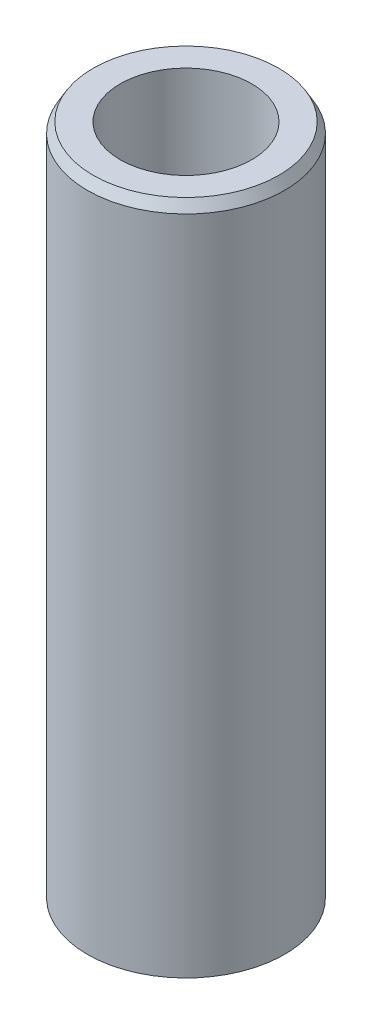
ISO-10303-21;
HEADER;
FILE_DESCRIPTION(('STEP AP214'),'2;1');
FILE_NAME('part.step','',(''),(''),'','','');
FILE_SCHEMA(('AUTOMOTIVE_DESIGN { 1 0 10303 214 1 1 1 1 }'));
ENDSEC;
DATA;
#1=APPLICATION_CONTEXT('core data for automotive mechanical design processes');
#2=APPLICATION_PROTOCOL_DEFINITION('international standard','automotive_design',2000,#1);
#3=PRODUCT_CONTEXT('',#1,'mechanical');
#4=PRODUCT('Part','Part','',(#3));
#5=PRODUCT_RELATED_PRODUCT_CATEGORY('part','',(#4));
#6=PRODUCT_DEFINITION_FORMATION('','',#4);
#7=PRODUCT_DEFINITION_CONTEXT('part definition',#1,'design');
#8=PRODUCT_DEFINITION('design','',#6,#7);
#9=PRODUCT_DEFINITION_SHAPE('','',#8);
#10=(LENGTH_UNIT() NAMED_UNIT(*) SI_UNIT(.MILLI.,.METRE.));
#11=(NAMED_UNIT(*) PLANE_ANGLE_UNIT() SI_UNIT($,.RADIAN.));
#12=(NAMED_UNIT(*) SI_UNIT($,.STERADIAN.) SOLID_ANGLE_UNIT());
#13=UNCERTAINTY_MEASURE_WITH_UNIT(LENGTH_MEASURE(1.E-05),#10,'distance_accuracy_value','');
#14=(GEOMETRIC_REPRESENTATION_CONTEXT(3) GLOBAL_UNCERTAINTY_ASSIGNED_CONTEXT((#13)) GLOBAL_UNIT_ASSIGNED_CONTEXT((#10,
#11,#12)) REPRESENTATION_CONTEXT('',''));
#15=CARTESIAN_POINT('',(0.,0.,0.));
#16=DIRECTION('',(0.,0.,1.));
#17=DIRECTION('',(1.,0.,0.));
#18=AXIS2_PLACEMENT_3D('',#15,#16,#17);
#19=CARTESIAN_POINT('',(0.,343.483602576055,0.));
#20=DIRECTION('',(0.,-1.,0.));
#21=DIRECTION('',(0.,0.,-1.));
#22=AXIS2_PLACEMENT_3D('',#19,#20,#21);
#23=CYLINDRICAL_SURFACE('',#22,50.);
#24=CARTESIAN_POINT('',(0.,338.351122495451,0.));
#25=DIRECTION('',(0.,1.,0.));
#26=DIRECTION('',(0.,0.,1.));
#27=AXIS2_PLACEMENT_3D('',#24,#25,#26);
#28=CIRCLE('',#27,50.);
#29=CARTESIAN_POINT('',(0.,338.351122495451,50.));
#30=VERTEX_POINT('',#29);
#31=EDGE_CURVE('E50',#30,#30,#28,.F.);
#32=ORIENTED_EDGE('',*,*,#31,.T.);
#33=EDGE_LOOP('',(#32));
#34=FACE_BOUND('',#33,.T.);
#35=CARTESIAN_POINT('',(0.,2.96323875614746,0.));
#36=DIRECTION('',(0.,1.,0.));
#37=DIRECTION('',(0.,0.,1.));
#38=AXIS2_PLACEMENT_3D('',#35,#36,#37);
#39=CIRCLE('',#38,50.);
#40=CARTESIAN_POINT('',(0.,2.96323875614746,50.));
#41=VERTEX_POINT('',#40);
#42=EDGE_CURVE('E51',#41,#41,#39,.T.);
#43=ORIENTED_EDGE('',*,*,#42,.T.);
#44=EDGE_LOOP('',(#43));
#45=FACE_BOUND('',#44,.T.);
#46=ADVANCED_FACE('F39',(#34,#45),#23,.T.);
#47=CARTESIAN_POINT('',(0.,343.483602576055,0.));
#48=DIRECTION('',(0.,1.,0.));
#49=DIRECTION('',(0.,0.,1.));
#50=AXIS2_PLACEMENT_3D('',#47,#48,#49);
#51=PLANE('',#50);
#52=CARTESIAN_POINT('',(0.,343.483602576055,0.));
#53=DIRECTION('',(0.,1.,0.));
#54=DIRECTION('',(0.,0.,1.));
#55=AXIS2_PLACEMENT_3D('',#52,#53,#54);
#56=CIRCLE('',#55,47.0367612438526);
#57=CARTESIAN_POINT('',(0.,343.483602576055,47.0367612438526));
#58=VERTEX_POINT('',#57);
#59=EDGE_CURVE('E54',#58,#58,#56,.T.);
#60=ORIENTED_EDGE('',*,*,#59,.T.);
#61=EDGE_LOOP('',(#60));
#62=FACE_BOUND('',#61,.T.);
#63=CARTESIAN_POINT('',(0.,343.483602576055,0.));
#64=DIRECTION('',(0.,1.,0.));
#65=DIRECTION('',(0.,0.,1.));
#66=AXIS2_PLACEMENT_3D('',#63,#64,#65);
#67=CIRCLE('',#66,33.3535461257962);
#68=CARTESIAN_POINT('',(0.,343.483602576055,33.3535461257962));
#69=VERTEX_POINT('',#68);
#70=EDGE_CURVE('E58',#69,#69,#67,.T.);
#71=ORIENTED_EDGE('',*,*,#70,.F.);
#72=EDGE_LOOP('',(#71));
#73=FACE_BOUND('',#72,.T.);
#74=ADVANCED_FACE('F69',(#62,#73),#51,.T.);
#75=CARTESIAN_POINT('',(0.,0.,0.));
#76=DIRECTION('',(0.,1.,0.));
#77=DIRECTION('',(0.,0.,1.));
#78=AXIS2_PLACEMENT_3D('',#75,#76,#77);
#79=PLANE('',#78);
#80=CARTESIAN_POINT('',(0.,0.,0.));
#81=DIRECTION('',(0.,1.,0.));
#82=DIRECTION('',(0.,0.,1.));
#83=AXIS2_PLACEMENT_3D('',#80,#81,#82);
#84=CIRCLE('',#83,44.8675199193954);
#85=CARTESIAN_POINT('',(0.,0.,44.8675199193954));
#86=VERTEX_POINT('',#85);
#87=EDGE_CURVE('E10',#86,#86,#84,.F.);
#88=ORIENTED_EDGE('',*,*,#87,.T.);
#89=EDGE_LOOP('',(#88));
#90=FACE_BOUND('',#89,.T.);
#91=CARTESIAN_POINT('',(0.,0.,0.));
#92=DIRECTION('',(0.,1.,0.));
#93=DIRECTION('',(0.,0.,1.));
#94=AXIS2_PLACEMENT_3D('',#91,#92,#93);
#95=CIRCLE('',#94,33.3535461257962);
#96=CARTESIAN_POINT('',(0.,0.,33.3535461257962));
#97=VERTEX_POINT('',#96);
#98=EDGE_CURVE('E63',#97,#97,#95,.T.);
#99=ORIENTED_EDGE('',*,*,#98,.T.);
#100=EDGE_LOOP('',(#99));
#101=FACE_BOUND('',#100,.T.);
#102=ADVANCED_FACE('F75',(#90,#101),#79,.F.);
#103=CARTESIAN_POINT('',(0.,343.483602576055,0.));
#104=DIRECTION('',(0.,-1.,0.));
#105=DIRECTION('',(0.,0.,-1.));
#106=AXIS2_PLACEMENT_3D('',#103,#104,#105);
#107=CYLINDRICAL_SURFACE('',#106,33.3535461257962);
#108=ORIENTED_EDGE('',*,*,#70,.T.);
#109=EDGE_LOOP('',(#108));
#110=FACE_BOUND('',#109,.T.);
#111=ORIENTED_EDGE('',*,*,#98,.F.);
#112=EDGE_LOOP('',(#111));
#113=FACE_BOUND('',#112,.T.);
#114=ADVANCED_FACE('F70',(#110,#113),#107,.F.);
#115=CARTESIAN_POINT('',(0.,343.483602576055,0.));
#116=DIRECTION('',(0.,-1.,0.));
#117=DIRECTION('',(0.,0.,-1.));
#118=AXIS2_PLACEMENT_3D('',#115,#116,#117);
#119=CONICAL_SURFACE('',#118,47.0367612438526,0.523598775598295);
#120=ORIENTED_EDGE('',*,*,#31,.F.);
#121=EDGE_LOOP('',(#120));
#122=FACE_BOUND('',#121,.T.);
#123=ORIENTED_EDGE('',*,*,#59,.F.);
#124=EDGE_LOOP('',(#123));
#125=FACE_BOUND('',#124,.T.);
#126=ADVANCED_FACE('F81',(#122,#125),#119,.T.);
#127=CARTESIAN_POINT('',(0.,2.96323875614746,0.));
#128=DIRECTION('',(0.,1.,0.));
#129=DIRECTION('',(0.,0.,1.));
#130=AXIS2_PLACEMENT_3D('',#127,#128,#129);
#131=CONICAL_SURFACE('',#130,50.,1.0471975511966);
#132=ORIENTED_EDGE('',*,*,#87,.F.);
#133=EDGE_LOOP('',(#132));
#134=FACE_BOUND('',#133,.T.);
#135=ORIENTED_EDGE('',*,*,#42,.F.);
#136=EDGE_LOOP('',(#135));
#137=FACE_BOUND('',#136,.T.);
#138=ADVANCED_FACE('F45',(#134,#137),#131,.T.);
#139=CLOSED_SHELL('',(#46,#74,#102,#114,#126,#138));
#140=MANIFOLD_SOLID_BREP('B2',#139);
#141=ADVANCED_BREP_SHAPE_REPRESENTATION('',(#18,#140),#14);
#142=SHAPE_DEFINITION_REPRESENTATION(#9,#141);
ENDSEC;
END-ISO-10303-21;
